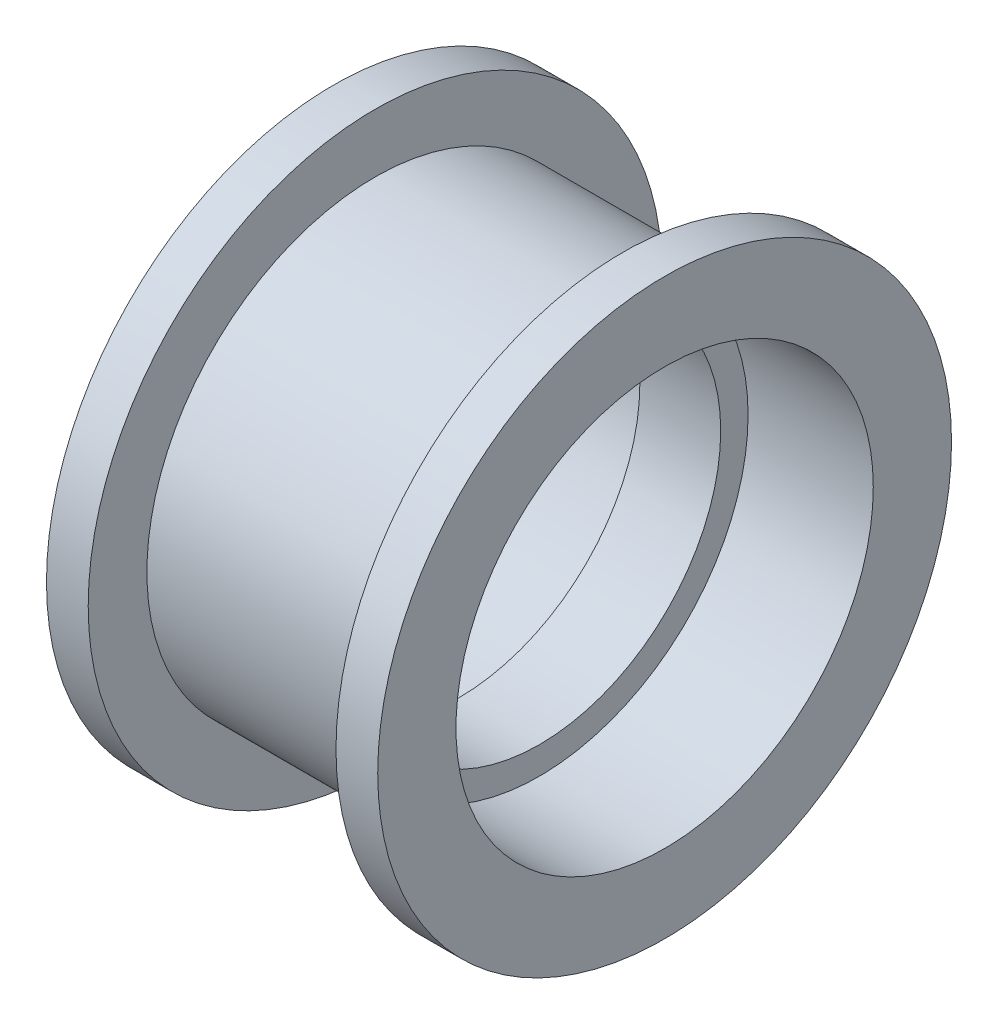
ISO-10303-21;
HEADER;
FILE_DESCRIPTION(('STEP AP214'),'2;1');
FILE_NAME('part.step','',(''),(''),'','','');
FILE_SCHEMA(('AUTOMOTIVE_DESIGN { 1 0 10303 214 1 1 1 1 }'));
ENDSEC;
DATA;
#1=APPLICATION_CONTEXT('core data for automotive mechanical design processes');
#2=APPLICATION_PROTOCOL_DEFINITION('international standard','automotive_design',2000,#1);
#3=PRODUCT_CONTEXT('',#1,'mechanical');
#4=PRODUCT('Part','Part','',(#3));
#5=PRODUCT_RELATED_PRODUCT_CATEGORY('part','',(#4));
#6=PRODUCT_DEFINITION_FORMATION('','',#4);
#7=PRODUCT_DEFINITION_CONTEXT('part definition',#1,'design');
#8=PRODUCT_DEFINITION('design','',#6,#7);
#9=PRODUCT_DEFINITION_SHAPE('','',#8);
#10=(LENGTH_UNIT() NAMED_UNIT(*) SI_UNIT(.MILLI.,.METRE.));
#11=(NAMED_UNIT(*) PLANE_ANGLE_UNIT() SI_UNIT($,.RADIAN.));
#12=(NAMED_UNIT(*) SI_UNIT($,.STERADIAN.) SOLID_ANGLE_UNIT());
#13=UNCERTAINTY_MEASURE_WITH_UNIT(LENGTH_MEASURE(1.E-05),#10,'distance_accuracy_value','');
#14=(GEOMETRIC_REPRESENTATION_CONTEXT(3) GLOBAL_UNCERTAINTY_ASSIGNED_CONTEXT((#13)) GLOBAL_UNIT_ASSIGNED_CONTEXT((#10,
#11,#12)) REPRESENTATION_CONTEXT('',''));
#15=CARTESIAN_POINT('',(0.,0.,0.));
#16=DIRECTION('',(0.,0.,1.));
#17=DIRECTION('',(1.,0.,0.));
#18=AXIS2_PLACEMENT_3D('',#15,#16,#17);
#19=CARTESIAN_POINT('',(-1.55,6.95,0.));
#20=DIRECTION('',(-1.,0.,0.));
#21=DIRECTION('',(0.,0.,1.));
#22=AXIS2_PLACEMENT_3D('',#19,#20,#21);
#23=PLANE('',#22);
#24=CARTESIAN_POINT('',(-1.55,0.,0.));
#25=DIRECTION('',(1.,0.,0.));
#26=DIRECTION('',(0.,0.,-1.));
#27=AXIS2_PLACEMENT_3D('',#24,#25,#26);
#28=CIRCLE('',#27,6.95);
#29=CARTESIAN_POINT('',(-1.55,0.,-6.95));
#30=VERTEX_POINT('',#29);
#31=EDGE_CURVE('E10',#30,#30,#28,.T.);
#32=ORIENTED_EDGE('',*,*,#31,.T.);
#33=EDGE_LOOP('',(#32));
#34=FACE_BOUND('',#33,.T.);
#35=CARTESIAN_POINT('',(-1.55,0.,0.));
#36=DIRECTION('',(1.,0.,0.));
#37=DIRECTION('',(0.,0.,-1.));
#38=AXIS2_PLACEMENT_3D('',#35,#36,#37);
#39=CIRCLE('',#38,8.);
#40=CARTESIAN_POINT('',(-1.55,0.,-8.));
#41=VERTEX_POINT('',#40);
#42=EDGE_CURVE('E73',#41,#41,#39,.T.);
#43=ORIENTED_EDGE('',*,*,#42,.F.);
#44=EDGE_LOOP('',(#43));
#45=FACE_BOUND('',#44,.T.);
#46=ADVANCED_FACE('F32',(#34,#45),#23,.T.);
#47=CARTESIAN_POINT('',(0.,0.,0.));
#48=DIRECTION('',(1.,0.,0.));
#49=DIRECTION('',(0.,0.,-1.));
#50=AXIS2_PLACEMENT_3D('',#47,#48,#49);
#51=CYLINDRICAL_SURFACE('',#50,6.95);
#52=CARTESIAN_POINT('',(1.55,0.,0.));
#53=DIRECTION('',(1.,0.,0.));
#54=DIRECTION('',(0.,0.,-1.));
#55=AXIS2_PLACEMENT_3D('',#52,#53,#54);
#56=CIRCLE('',#55,6.95);
#57=CARTESIAN_POINT('',(1.55,0.,-6.95));
#58=VERTEX_POINT('',#57);
#59=EDGE_CURVE('E38',#58,#58,#56,.T.);
#60=ORIENTED_EDGE('',*,*,#59,.T.);
#61=EDGE_LOOP('',(#60));
#62=FACE_BOUND('',#61,.T.);
#63=ORIENTED_EDGE('',*,*,#31,.F.);
#64=EDGE_LOOP('',(#63));
#65=FACE_BOUND('',#64,.T.);
#66=ADVANCED_FACE('F81',(#62,#65),#51,.F.);
#67=CARTESIAN_POINT('',(1.55,6.95,0.));
#68=DIRECTION('',(1.,0.,0.));
#69=DIRECTION('',(0.,0.,-1.));
#70=AXIS2_PLACEMENT_3D('',#67,#68,#69);
#71=PLANE('',#70);
#72=CARTESIAN_POINT('',(1.55,0.,0.));
#73=DIRECTION('',(1.,0.,0.));
#74=DIRECTION('',(0.,0.,-1.));
#75=AXIS2_PLACEMENT_3D('',#72,#73,#74);
#76=CIRCLE('',#75,8.);
#77=CARTESIAN_POINT('',(1.55,0.,-8.));
#78=VERTEX_POINT('',#77);
#79=EDGE_CURVE('E42',#78,#78,#76,.T.);
#80=ORIENTED_EDGE('',*,*,#79,.T.);
#81=EDGE_LOOP('',(#80));
#82=FACE_BOUND('',#81,.T.);
#83=ORIENTED_EDGE('',*,*,#59,.F.);
#84=EDGE_LOOP('',(#83));
#85=FACE_BOUND('',#84,.T.);
#86=ADVANCED_FACE('F85',(#82,#85),#71,.T.);
#87=CARTESIAN_POINT('',(0.,0.,0.));
#88=DIRECTION('',(1.,0.,0.));
#89=DIRECTION('',(0.,0.,-1.));
#90=AXIS2_PLACEMENT_3D('',#87,#88,#89);
#91=CYLINDRICAL_SURFACE('',#90,8.);
#92=CARTESIAN_POINT('',(6.35,0.,0.));
#93=DIRECTION('',(1.,0.,0.));
#94=DIRECTION('',(0.,0.,-1.));
#95=AXIS2_PLACEMENT_3D('',#92,#93,#94);
#96=CIRCLE('',#95,8.);
#97=CARTESIAN_POINT('',(6.35,0.,-8.));
#98=VERTEX_POINT('',#97);
#99=EDGE_CURVE('E46',#98,#98,#96,.T.);
#100=ORIENTED_EDGE('',*,*,#99,.T.);
#101=EDGE_LOOP('',(#100));
#102=FACE_BOUND('',#101,.T.);
#103=ORIENTED_EDGE('',*,*,#79,.F.);
#104=EDGE_LOOP('',(#103));
#105=FACE_BOUND('',#104,.T.);
#106=ADVANCED_FACE('F89',(#102,#105),#91,.F.);
#107=CARTESIAN_POINT('',(6.35,8.,0.));
#108=DIRECTION('',(1.,0.,0.));
#109=DIRECTION('',(0.,0.,-1.));
#110=AXIS2_PLACEMENT_3D('',#107,#108,#109);
#111=PLANE('',#110);
#112=CARTESIAN_POINT('',(6.35,0.,0.));
#113=DIRECTION('',(1.,0.,0.));
#114=DIRECTION('',(0.,0.,-1.));
#115=AXIS2_PLACEMENT_3D('',#112,#113,#114);
#116=CIRCLE('',#115,11.);
#117=CARTESIAN_POINT('',(6.35,0.,-11.));
#118=VERTEX_POINT('',#117);
#119=EDGE_CURVE('E51',#118,#118,#116,.T.);
#120=ORIENTED_EDGE('',*,*,#119,.T.);
#121=EDGE_LOOP('',(#120));
#122=FACE_BOUND('',#121,.T.);
#123=ORIENTED_EDGE('',*,*,#99,.F.);
#124=EDGE_LOOP('',(#123));
#125=FACE_BOUND('',#124,.T.);
#126=ADVANCED_FACE('F96',(#122,#125),#111,.T.);
#127=CARTESIAN_POINT('',(0.,0.,0.));
#128=DIRECTION('',(1.,0.,0.));
#129=DIRECTION('',(0.,0.,-1.));
#130=AXIS2_PLACEMENT_3D('',#127,#128,#129);
#131=CYLINDRICAL_SURFACE('',#130,11.);
#132=CARTESIAN_POINT('',(4.75,0.,0.));
#133=DIRECTION('',(1.,0.,0.));
#134=DIRECTION('',(0.,0.,-1.));
#135=AXIS2_PLACEMENT_3D('',#132,#133,#134);
#136=CIRCLE('',#135,11.);
#137=CARTESIAN_POINT('',(4.75,0.,-11.));
#138=VERTEX_POINT('',#137);
#139=EDGE_CURVE('E54',#138,#138,#136,.T.);
#140=ORIENTED_EDGE('',*,*,#139,.T.);
#141=EDGE_LOOP('',(#140));
#142=FACE_BOUND('',#141,.T.);
#143=ORIENTED_EDGE('',*,*,#119,.F.);
#144=EDGE_LOOP('',(#143));
#145=FACE_BOUND('',#144,.T.);
#146=ADVANCED_FACE('F100',(#142,#145),#131,.T.);
#147=CARTESIAN_POINT('',(4.75,11.,0.));
#148=DIRECTION('',(-1.,0.,0.));
#149=DIRECTION('',(0.,0.,1.));
#150=AXIS2_PLACEMENT_3D('',#147,#148,#149);
#151=PLANE('',#150);
#152=CARTESIAN_POINT('',(4.75,0.,0.));
#153=DIRECTION('',(1.,0.,0.));
#154=DIRECTION('',(0.,0.,-1.));
#155=AXIS2_PLACEMENT_3D('',#152,#153,#154);
#156=CIRCLE('',#155,8.75);
#157=CARTESIAN_POINT('',(4.75,0.,-8.75));
#158=VERTEX_POINT('',#157);
#159=EDGE_CURVE('E57',#158,#158,#156,.T.);
#160=ORIENTED_EDGE('',*,*,#159,.T.);
#161=EDGE_LOOP('',(#160));
#162=FACE_BOUND('',#161,.T.);
#163=ORIENTED_EDGE('',*,*,#139,.F.);
#164=EDGE_LOOP('',(#163));
#165=FACE_BOUND('',#164,.T.);
#166=ADVANCED_FACE('F104',(#162,#165),#151,.T.);
#167=CARTESIAN_POINT('',(0.,0.,0.));
#168=DIRECTION('',(1.,0.,0.));
#169=DIRECTION('',(0.,0.,-1.));
#170=AXIS2_PLACEMENT_3D('',#167,#168,#169);
#171=CYLINDRICAL_SURFACE('',#170,8.75);
#172=CARTESIAN_POINT('',(-4.75,0.,0.));
#173=DIRECTION('',(1.,0.,0.));
#174=DIRECTION('',(0.,0.,-1.));
#175=AXIS2_PLACEMENT_3D('',#172,#173,#174);
#176=CIRCLE('',#175,8.75);
#177=CARTESIAN_POINT('',(-4.75,0.,-8.75));
#178=VERTEX_POINT('',#177);
#179=EDGE_CURVE('E60',#178,#178,#176,.T.);
#180=ORIENTED_EDGE('',*,*,#179,.T.);
#181=EDGE_LOOP('',(#180));
#182=FACE_BOUND('',#181,.T.);
#183=ORIENTED_EDGE('',*,*,#159,.F.);
#184=EDGE_LOOP('',(#183));
#185=FACE_BOUND('',#184,.T.);
#186=ADVANCED_FACE('F108',(#182,#185),#171,.T.);
#187=CARTESIAN_POINT('',(-4.75,11.,0.));
#188=DIRECTION('',(1.,0.,0.));
#189=DIRECTION('',(0.,0.,-1.));
#190=AXIS2_PLACEMENT_3D('',#187,#188,#189);
#191=PLANE('',#190);
#192=CARTESIAN_POINT('',(-4.75,0.,0.));
#193=DIRECTION('',(1.,0.,0.));
#194=DIRECTION('',(0.,0.,-1.));
#195=AXIS2_PLACEMENT_3D('',#192,#193,#194);
#196=CIRCLE('',#195,11.);
#197=CARTESIAN_POINT('',(-4.75,0.,-11.));
#198=VERTEX_POINT('',#197);
#199=EDGE_CURVE('E64',#198,#198,#196,.T.);
#200=ORIENTED_EDGE('',*,*,#199,.T.);
#201=EDGE_LOOP('',(#200));
#202=FACE_BOUND('',#201,.T.);
#203=ORIENTED_EDGE('',*,*,#179,.F.);
#204=EDGE_LOOP('',(#203));
#205=FACE_BOUND('',#204,.T.);
#206=ADVANCED_FACE('F112',(#202,#205),#191,.T.);
#207=CARTESIAN_POINT('',(0.,0.,0.));
#208=DIRECTION('',(1.,0.,0.));
#209=DIRECTION('',(0.,0.,-1.));
#210=AXIS2_PLACEMENT_3D('',#207,#208,#209);
#211=CYLINDRICAL_SURFACE('',#210,11.);
#212=CARTESIAN_POINT('',(-6.35,0.,0.));
#213=DIRECTION('',(1.,0.,0.));
#214=DIRECTION('',(0.,0.,-1.));
#215=AXIS2_PLACEMENT_3D('',#212,#213,#214);
#216=CIRCLE('',#215,11.);
#217=CARTESIAN_POINT('',(-6.35,0.,-11.));
#218=VERTEX_POINT('',#217);
#219=EDGE_CURVE('E67',#218,#218,#216,.T.);
#220=ORIENTED_EDGE('',*,*,#219,.T.);
#221=EDGE_LOOP('',(#220));
#222=FACE_BOUND('',#221,.T.);
#223=ORIENTED_EDGE('',*,*,#199,.F.);
#224=EDGE_LOOP('',(#223));
#225=FACE_BOUND('',#224,.T.);
#226=ADVANCED_FACE('F116',(#222,#225),#211,.T.);
#227=CARTESIAN_POINT('',(-6.35,8.,0.));
#228=DIRECTION('',(-1.,0.,0.));
#229=DIRECTION('',(0.,0.,1.));
#230=AXIS2_PLACEMENT_3D('',#227,#228,#229);
#231=PLANE('',#230);
#232=CARTESIAN_POINT('',(-6.35,0.,0.));
#233=DIRECTION('',(1.,0.,0.));
#234=DIRECTION('',(0.,0.,-1.));
#235=AXIS2_PLACEMENT_3D('',#232,#233,#234);
#236=CIRCLE('',#235,8.);
#237=CARTESIAN_POINT('',(-6.35,0.,-8.));
#238=VERTEX_POINT('',#237);
#239=EDGE_CURVE('E70',#238,#238,#236,.T.);
#240=ORIENTED_EDGE('',*,*,#239,.T.);
#241=EDGE_LOOP('',(#240));
#242=FACE_BOUND('',#241,.T.);
#243=ORIENTED_EDGE('',*,*,#219,.F.);
#244=EDGE_LOOP('',(#243));
#245=FACE_BOUND('',#244,.T.);
#246=ADVANCED_FACE('F120',(#242,#245),#231,.T.);
#247=CARTESIAN_POINT('',(0.,0.,0.));
#248=DIRECTION('',(1.,0.,0.));
#249=DIRECTION('',(0.,0.,-1.));
#250=AXIS2_PLACEMENT_3D('',#247,#248,#249);
#251=CYLINDRICAL_SURFACE('',#250,8.);
#252=ORIENTED_EDGE('',*,*,#42,.T.);
#253=EDGE_LOOP('',(#252));
#254=FACE_BOUND('',#253,.T.);
#255=ORIENTED_EDGE('',*,*,#239,.F.);
#256=EDGE_LOOP('',(#255));
#257=FACE_BOUND('',#256,.T.);
#258=ADVANCED_FACE('F77',(#254,#257),#251,.F.);
#259=CLOSED_SHELL('',(#46,#66,#86,#106,#126,#146,#166,#186,#206,#226,#246,#258));
#260=MANIFOLD_SOLID_BREP('B2',#259);
#261=ADVANCED_BREP_SHAPE_REPRESENTATION('',(#18,#260),#14);
#262=SHAPE_DEFINITION_REPRESENTATION(#9,#261);
ENDSEC;
END-ISO-10303-21;
